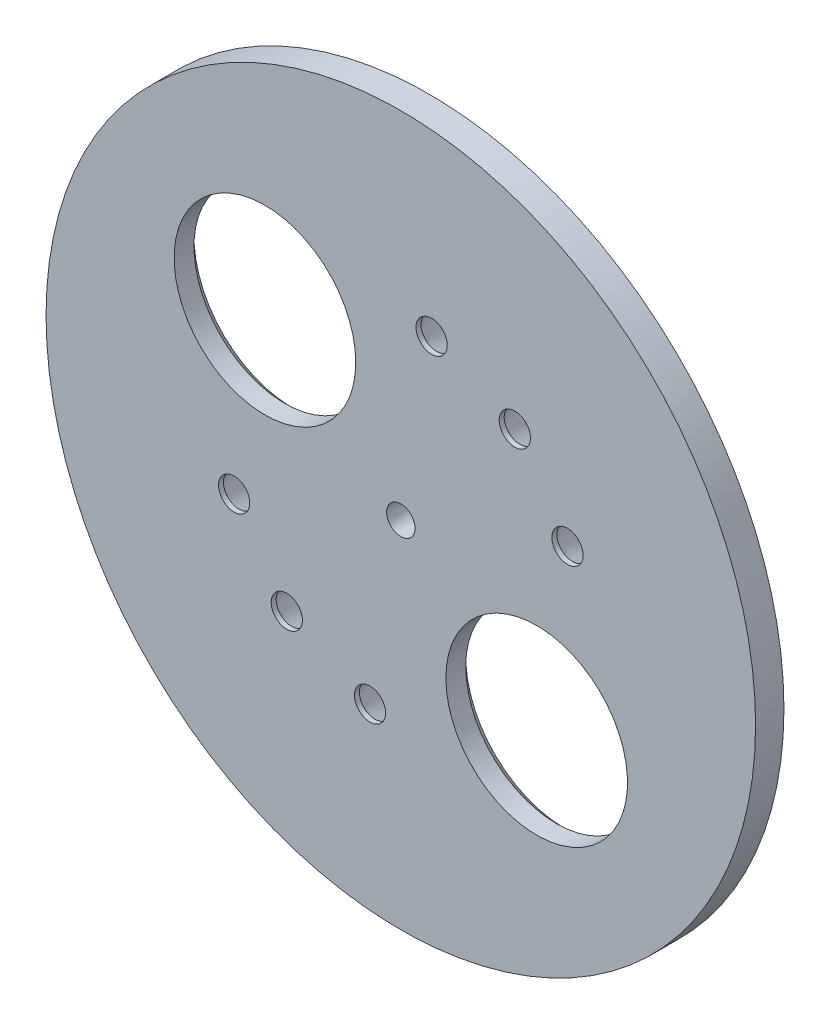
ISO-10303-21;
HEADER;
FILE_DESCRIPTION(('STEP AP214'),'2;1');
FILE_NAME('part.step','',(''),(''),'','','');
FILE_SCHEMA(('AUTOMOTIVE_DESIGN { 1 0 10303 214 1 1 1 1 }'));
ENDSEC;
DATA;
#1=APPLICATION_CONTEXT('core data for automotive mechanical design processes');
#2=APPLICATION_PROTOCOL_DEFINITION('international standard','automotive_design',2000,#1);
#3=PRODUCT_CONTEXT('',#1,'mechanical');
#4=PRODUCT('Part','Part','',(#3));
#5=PRODUCT_RELATED_PRODUCT_CATEGORY('part','',(#4));
#6=PRODUCT_DEFINITION_FORMATION('','',#4);
#7=PRODUCT_DEFINITION_CONTEXT('part definition',#1,'design');
#8=PRODUCT_DEFINITION('design','',#6,#7);
#9=PRODUCT_DEFINITION_SHAPE('','',#8);
#10=(LENGTH_UNIT() NAMED_UNIT(*) SI_UNIT(.MILLI.,.METRE.));
#11=(NAMED_UNIT(*) PLANE_ANGLE_UNIT() SI_UNIT($,.RADIAN.));
#12=(NAMED_UNIT(*) SI_UNIT($,.STERADIAN.) SOLID_ANGLE_UNIT());
#13=UNCERTAINTY_MEASURE_WITH_UNIT(LENGTH_MEASURE(1.E-05),#10,'distance_accuracy_value','');
#14=(GEOMETRIC_REPRESENTATION_CONTEXT(3) GLOBAL_UNCERTAINTY_ASSIGNED_CONTEXT((#13)) GLOBAL_UNIT_ASSIGNED_CONTEXT((#10,
#11,#12)) REPRESENTATION_CONTEXT('',''));
#15=CARTESIAN_POINT('',(0.,0.,0.));
#16=DIRECTION('',(0.,0.,1.));
#17=DIRECTION('',(1.,0.,0.));
#18=AXIS2_PLACEMENT_3D('',#15,#16,#17);
#19=CARTESIAN_POINT('',(0.,0.,10.));
#20=DIRECTION('',(0.,0.,-1.));
#21=DIRECTION('',(-1.,0.,0.));
#22=AXIS2_PLACEMENT_3D('',#19,#20,#21);
#23=CYLINDRICAL_SURFACE('',#22,125.);
#24=CARTESIAN_POINT('',(0.,0.,10.));
#25=DIRECTION('',(0.,0.,1.));
#26=DIRECTION('',(1.,0.,0.));
#27=AXIS2_PLACEMENT_3D('',#24,#25,#26);
#28=CIRCLE('',#27,125.);
#29=CARTESIAN_POINT('',(125.,0.,10.));
#30=VERTEX_POINT('',#29);
#31=EDGE_CURVE('E87',#30,#30,#28,.T.);
#32=ORIENTED_EDGE('',*,*,#31,.F.);
#33=EDGE_LOOP('',(#32));
#34=FACE_BOUND('',#33,.T.);
#35=CARTESIAN_POINT('',(0.,0.,0.));
#36=DIRECTION('',(0.,0.,1.));
#37=DIRECTION('',(1.,0.,0.));
#38=AXIS2_PLACEMENT_3D('',#35,#36,#37);
#39=CIRCLE('',#38,125.);
#40=CARTESIAN_POINT('',(125.,0.,0.));
#41=VERTEX_POINT('',#40);
#42=EDGE_CURVE('E88',#41,#41,#39,.T.);
#43=ORIENTED_EDGE('',*,*,#42,.T.);
#44=EDGE_LOOP('',(#43));
#45=FACE_BOUND('',#44,.T.);
#46=ADVANCED_FACE('F31',(#34,#45),#23,.T.);
#47=CARTESIAN_POINT('',(0.,0.,10.));
#48=DIRECTION('',(0.,0.,1.));
#49=DIRECTION('',(1.,0.,0.));
#50=AXIS2_PLACEMENT_3D('',#47,#48,#49);
#51=PLANE('',#50);
#52=CARTESIAN_POINT('',(-47.8777776949364,40.1742256054084,10.));
#53=DIRECTION('',(0.,0.,-1.));
#54=DIRECTION('',(1.,0.,0.));
#55=AXIS2_PLACEMENT_3D('',#52,#53,#54);
#56=CIRCLE('',#55,32.);
#57=CARTESIAN_POINT('',(-15.8777776949364,40.1742256054084,10.));
#58=VERTEX_POINT('',#57);
#59=EDGE_CURVE('E98',#58,#58,#56,.T.);
#60=ORIENTED_EDGE('',*,*,#59,.T.);
#61=EDGE_LOOP('',(#60));
#62=FACE_BOUND('',#61,.T.);
#63=CARTESIAN_POINT('',(10.853011104183,61.550484563263,10.));
#64=DIRECTION('',(0.,0.,-1.));
#65=DIRECTION('',(1.,0.,0.));
#66=AXIS2_PLACEMENT_3D('',#63,#64,#65);
#67=CIRCLE('',#66,5.5);
#68=CARTESIAN_POINT('',(16.3530111041829,61.550484563263,10.));
#69=VERTEX_POINT('',#68);
#70=EDGE_CURVE('E118',#69,#69,#67,.T.);
#71=ORIENTED_EDGE('',*,*,#70,.T.);
#72=EDGE_LOOP('',(#71));
#73=FACE_BOUND('',#72,.T.);
#74=CARTESIAN_POINT('',(40.1742256054086,47.8777776949362,10.));
#75=DIRECTION('',(0.,0.,-1.));
#76=DIRECTION('',(1.,0.,0.));
#77=AXIS2_PLACEMENT_3D('',#74,#75,#76);
#78=CIRCLE('',#77,5.5);
#79=CARTESIAN_POINT('',(45.6742256054086,47.8777776949362,10.));
#80=VERTEX_POINT('',#79);
#81=EDGE_CURVE('E115',#80,#80,#78,.T.);
#82=ORIENTED_EDGE('',*,*,#81,.T.);
#83=EDGE_LOOP('',(#82));
#84=FACE_BOUND('',#83,.T.);
#85=CARTESIAN_POINT('',(58.7307887991193,21.3762589578543,10.));
#86=DIRECTION('',(0.,0.,-1.));
#87=DIRECTION('',(1.,0.,0.));
#88=AXIS2_PLACEMENT_3D('',#85,#86,#87);
#89=CIRCLE('',#88,5.5);
#90=CARTESIAN_POINT('',(64.2307887991193,21.3762589578543,10.));
#91=VERTEX_POINT('',#90);
#92=EDGE_CURVE('E112',#91,#91,#89,.T.);
#93=ORIENTED_EDGE('',*,*,#92,.T.);
#94=EDGE_LOOP('',(#93));
#95=FACE_BOUND('',#94,.T.);
#96=CARTESIAN_POINT('',(0.,0.,10.));
#97=DIRECTION('',(0.,0.,-1.));
#98=DIRECTION('',(-1.,0.,0.));
#99=AXIS2_PLACEMENT_3D('',#96,#97,#98);
#100=CIRCLE('',#99,5.);
#101=CARTESIAN_POINT('',(-5.,0.,10.));
#102=VERTEX_POINT('',#101);
#103=EDGE_CURVE('E91',#102,#102,#100,.T.);
#104=ORIENTED_EDGE('',*,*,#103,.T.);
#105=EDGE_LOOP('',(#104));
#106=FACE_BOUND('',#105,.T.);
#107=CARTESIAN_POINT('',(47.8777776949364,-40.1742256054084,10.));
#108=DIRECTION('',(0.,0.,-1.));
#109=DIRECTION('',(-1.,0.,0.));
#110=AXIS2_PLACEMENT_3D('',#107,#108,#109);
#111=CIRCLE('',#110,32.);
#112=CARTESIAN_POINT('',(15.8777776949364,-40.1742256054084,10.));
#113=VERTEX_POINT('',#112);
#114=EDGE_CURVE('E104',#113,#113,#111,.T.);
#115=ORIENTED_EDGE('',*,*,#114,.T.);
#116=EDGE_LOOP('',(#115));
#117=FACE_BOUND('',#116,.T.);
#118=CARTESIAN_POINT('',(-10.853011104183,-61.550484563263,10.));
#119=DIRECTION('',(0.,0.,-1.));
#120=DIRECTION('',(-1.,0.,0.));
#121=AXIS2_PLACEMENT_3D('',#118,#119,#120);
#122=CIRCLE('',#121,5.5);
#123=CARTESIAN_POINT('',(-16.3530111041829,-61.550484563263,10.));
#124=VERTEX_POINT('',#123);
#125=EDGE_CURVE('E101',#124,#124,#122,.T.);
#126=ORIENTED_EDGE('',*,*,#125,.T.);
#127=EDGE_LOOP('',(#126));
#128=FACE_BOUND('',#127,.T.);
#129=CARTESIAN_POINT('',(-40.1742256054086,-47.8777776949362,10.));
#130=DIRECTION('',(0.,0.,-1.));
#131=DIRECTION('',(-1.,0.,0.));
#132=AXIS2_PLACEMENT_3D('',#129,#130,#131);
#133=CIRCLE('',#132,5.5);
#134=CARTESIAN_POINT('',(-45.6742256054086,-47.8777776949362,10.));
#135=VERTEX_POINT('',#134);
#136=EDGE_CURVE('E97',#135,#135,#133,.T.);
#137=ORIENTED_EDGE('',*,*,#136,.T.);
#138=EDGE_LOOP('',(#137));
#139=FACE_BOUND('',#138,.T.);
#140=CARTESIAN_POINT('',(-58.7307887991193,-21.3762589578543,10.));
#141=DIRECTION('',(0.,0.,-1.));
#142=DIRECTION('',(-1.,0.,0.));
#143=AXIS2_PLACEMENT_3D('',#140,#141,#142);
#144=CIRCLE('',#143,5.5);
#145=CARTESIAN_POINT('',(-64.2307887991193,-21.3762589578543,10.));
#146=VERTEX_POINT('',#145);
#147=EDGE_CURVE('E94',#146,#146,#144,.T.);
#148=ORIENTED_EDGE('',*,*,#147,.T.);
#149=EDGE_LOOP('',(#148));
#150=FACE_BOUND('',#149,.T.);
#151=ORIENTED_EDGE('',*,*,#31,.T.);
#152=EDGE_LOOP('',(#151));
#153=FACE_BOUND('',#152,.T.);
#154=ADVANCED_FACE('F124',(#62,#73,#84,#95,#106,#117,#128,#139,#150,#153),#51,.T.);
#155=CARTESIAN_POINT('',(0.,0.,0.));
#156=DIRECTION('',(0.,0.,1.));
#157=DIRECTION('',(1.,0.,0.));
#158=AXIS2_PLACEMENT_3D('',#155,#156,#157);
#159=PLANE('',#158);
#160=CARTESIAN_POINT('',(58.7307887991193,21.3762589578543,0.));
#161=DIRECTION('',(0.,0.,1.));
#162=DIRECTION('',(1.,0.,0.));
#163=AXIS2_PLACEMENT_3D('',#160,#161,#162);
#164=CIRCLE('',#163,8.49999999999996);
#165=CARTESIAN_POINT('',(67.2307887991192,21.3762589578543,0.));
#166=VERTEX_POINT('',#165);
#167=EDGE_CURVE('E42',#166,#166,#164,.T.);
#168=ORIENTED_EDGE('',*,*,#167,.T.);
#169=EDGE_LOOP('',(#168));
#170=FACE_BOUND('',#169,.T.);
#171=CARTESIAN_POINT('',(40.1742256054086,47.8777776949362,0.));
#172=DIRECTION('',(0.,0.,1.));
#173=DIRECTION('',(1.,0.,0.));
#174=AXIS2_PLACEMENT_3D('',#171,#172,#173);
#175=CIRCLE('',#174,8.49999999999997);
#176=CARTESIAN_POINT('',(48.6742256054086,47.8777776949362,0.));
#177=VERTEX_POINT('',#176);
#178=EDGE_CURVE('E46',#177,#177,#175,.T.);
#179=ORIENTED_EDGE('',*,*,#178,.T.);
#180=EDGE_LOOP('',(#179));
#181=FACE_BOUND('',#180,.T.);
#182=CARTESIAN_POINT('',(10.853011104183,61.550484563263,0.));
#183=DIRECTION('',(0.,0.,1.));
#184=DIRECTION('',(1.,0.,0.));
#185=AXIS2_PLACEMENT_3D('',#182,#183,#184);
#186=CIRCLE('',#185,8.49999999999997);
#187=CARTESIAN_POINT('',(19.3530111041829,61.550484563263,0.));
#188=VERTEX_POINT('',#187);
#189=EDGE_CURVE('E51',#188,#188,#186,.T.);
#190=ORIENTED_EDGE('',*,*,#189,.T.);
#191=EDGE_LOOP('',(#190));
#192=FACE_BOUND('',#191,.T.);
#193=CARTESIAN_POINT('',(-47.8777776949364,40.1742256054084,0.));
#194=DIRECTION('',(0.,0.,1.));
#195=DIRECTION('',(1.,0.,0.));
#196=AXIS2_PLACEMENT_3D('',#193,#194,#195);
#197=CIRCLE('',#196,35.);
#198=CARTESIAN_POINT('',(-12.8777776949364,40.1742256054084,0.));
#199=VERTEX_POINT('',#198);
#200=EDGE_CURVE('E57',#199,#199,#197,.T.);
#201=ORIENTED_EDGE('',*,*,#200,.T.);
#202=EDGE_LOOP('',(#201));
#203=FACE_BOUND('',#202,.T.);
#204=CARTESIAN_POINT('',(-58.7307887991193,-21.3762589578543,0.));
#205=DIRECTION('',(0.,0.,1.));
#206=DIRECTION('',(1.,0.,0.));
#207=AXIS2_PLACEMENT_3D('',#204,#205,#206);
#208=CIRCLE('',#207,8.49999999999996);
#209=CARTESIAN_POINT('',(-50.2307887991193,-21.3762589578543,0.));
#210=VERTEX_POINT('',#209);
#211=EDGE_CURVE('E69',#210,#210,#208,.T.);
#212=ORIENTED_EDGE('',*,*,#211,.T.);
#213=EDGE_LOOP('',(#212));
#214=FACE_BOUND('',#213,.T.);
#215=CARTESIAN_POINT('',(-40.1742256054086,-47.8777776949362,0.));
#216=DIRECTION('',(0.,0.,1.));
#217=DIRECTION('',(1.,0.,0.));
#218=AXIS2_PLACEMENT_3D('',#215,#216,#217);
#219=CIRCLE('',#218,8.49999999999997);
#220=CARTESIAN_POINT('',(-31.6742256054087,-47.8777776949362,0.));
#221=VERTEX_POINT('',#220);
#222=EDGE_CURVE('E72',#221,#221,#219,.T.);
#223=ORIENTED_EDGE('',*,*,#222,.T.);
#224=EDGE_LOOP('',(#223));
#225=FACE_BOUND('',#224,.T.);
#226=CARTESIAN_POINT('',(-10.853011104183,-61.550484563263,0.));
#227=DIRECTION('',(0.,0.,1.));
#228=DIRECTION('',(1.,0.,0.));
#229=AXIS2_PLACEMENT_3D('',#226,#227,#228);
#230=CIRCLE('',#229,8.49999999999997);
#231=CARTESIAN_POINT('',(-2.35301110418299,-61.550484563263,0.));
#232=VERTEX_POINT('',#231);
#233=EDGE_CURVE('E75',#232,#232,#230,.T.);
#234=ORIENTED_EDGE('',*,*,#233,.T.);
#235=EDGE_LOOP('',(#234));
#236=FACE_BOUND('',#235,.T.);
#237=CARTESIAN_POINT('',(47.8777776949364,-40.1742256054084,0.));
#238=DIRECTION('',(0.,0.,1.));
#239=DIRECTION('',(1.,0.,0.));
#240=AXIS2_PLACEMENT_3D('',#237,#238,#239);
#241=CIRCLE('',#240,35.);
#242=CARTESIAN_POINT('',(82.8777776949363,-40.1742256054084,0.));
#243=VERTEX_POINT('',#242);
#244=EDGE_CURVE('E81',#243,#243,#241,.T.);
#245=ORIENTED_EDGE('',*,*,#244,.T.);
#246=EDGE_LOOP('',(#245));
#247=FACE_BOUND('',#246,.T.);
#248=CARTESIAN_POINT('',(0.,0.,0.));
#249=DIRECTION('',(0.,0.,-1.));
#250=DIRECTION('',(-1.,0.,0.));
#251=AXIS2_PLACEMENT_3D('',#248,#249,#250);
#252=CIRCLE('',#251,5.);
#253=CARTESIAN_POINT('',(-5.,0.,0.));
#254=VERTEX_POINT('',#253);
#255=EDGE_CURVE('E107',#254,#254,#252,.T.);
#256=ORIENTED_EDGE('',*,*,#255,.F.);
#257=EDGE_LOOP('',(#256));
#258=FACE_BOUND('',#257,.T.);
#259=ORIENTED_EDGE('',*,*,#42,.F.);
#260=EDGE_LOOP('',(#259));
#261=FACE_BOUND('',#260,.T.);
#262=ADVANCED_FACE('F148',(#170,#181,#192,#203,#214,#225,#236,#247,#258,#261),#159,.F.);
#263=CARTESIAN_POINT('',(-58.7307887991193,-21.3762589578543,10.));
#264=DIRECTION('',(0.,0.,-1.));
#265=DIRECTION('',(-1.,0.,0.));
#266=AXIS2_PLACEMENT_3D('',#263,#264,#265);
#267=CYLINDRICAL_SURFACE('',#266,5.5);
#268=CARTESIAN_POINT('',(-58.7307887991193,-21.3762589578543,8.24243225836378));
#269=DIRECTION('',(0.,0.,1.));
#270=DIRECTION('',(1.,0.,0.));
#271=AXIS2_PLACEMENT_3D('',#268,#269,#270);
#272=CIRCLE('',#271,5.5);
#273=CARTESIAN_POINT('',(-53.2307887991193,-21.3762589578543,8.24243225836378));
#274=VERTEX_POINT('',#273);
#275=EDGE_CURVE('E78',#274,#274,#272,.F.);
#276=ORIENTED_EDGE('',*,*,#275,.T.);
#277=EDGE_LOOP('',(#276));
#278=FACE_BOUND('',#277,.T.);
#279=ORIENTED_EDGE('',*,*,#147,.F.);
#280=EDGE_LOOP('',(#279));
#281=FACE_BOUND('',#280,.T.);
#282=ADVANCED_FACE('F186',(#278,#281),#267,.F.);
#283=CARTESIAN_POINT('',(-40.1742256054086,-47.8777776949362,10.));
#284=DIRECTION('',(0.,0.,-1.));
#285=DIRECTION('',(-1.,0.,0.));
#286=AXIS2_PLACEMENT_3D('',#283,#284,#285);
#287=CYLINDRICAL_SURFACE('',#286,5.5);
#288=CARTESIAN_POINT('',(-40.1742256054086,-47.8777776949362,8.24243225836378));
#289=DIRECTION('',(0.,0.,1.));
#290=DIRECTION('',(1.,0.,0.));
#291=AXIS2_PLACEMENT_3D('',#288,#289,#290);
#292=CIRCLE('',#291,5.5);
#293=CARTESIAN_POINT('',(-34.6742256054086,-47.8777776949362,8.24243225836378));
#294=VERTEX_POINT('',#293);
#295=EDGE_CURVE('E66',#294,#294,#292,.F.);
#296=ORIENTED_EDGE('',*,*,#295,.T.);
#297=EDGE_LOOP('',(#296));
#298=FACE_BOUND('',#297,.T.);
#299=ORIENTED_EDGE('',*,*,#136,.F.);
#300=EDGE_LOOP('',(#299));
#301=FACE_BOUND('',#300,.T.);
#302=ADVANCED_FACE('F220',(#298,#301),#287,.F.);
#303=CARTESIAN_POINT('',(-10.853011104183,-61.550484563263,10.));
#304=DIRECTION('',(0.,0.,-1.));
#305=DIRECTION('',(-1.,0.,0.));
#306=AXIS2_PLACEMENT_3D('',#303,#304,#305);
#307=CYLINDRICAL_SURFACE('',#306,5.5);
#308=CARTESIAN_POINT('',(-10.853011104183,-61.550484563263,8.24243225836378));
#309=DIRECTION('',(0.,0.,1.));
#310=DIRECTION('',(1.,0.,0.));
#311=AXIS2_PLACEMENT_3D('',#308,#309,#310);
#312=CIRCLE('',#311,5.5);
#313=CARTESIAN_POINT('',(-5.35301110418296,-61.550484563263,8.24243225836378));
#314=VERTEX_POINT('',#313);
#315=EDGE_CURVE('E63',#314,#314,#312,.F.);
#316=ORIENTED_EDGE('',*,*,#315,.T.);
#317=EDGE_LOOP('',(#316));
#318=FACE_BOUND('',#317,.T.);
#319=ORIENTED_EDGE('',*,*,#125,.F.);
#320=EDGE_LOOP('',(#319));
#321=FACE_BOUND('',#320,.T.);
#322=ADVANCED_FACE('F211',(#318,#321),#307,.F.);
#323=CARTESIAN_POINT('',(47.8777776949364,-40.1742256054084,10.));
#324=DIRECTION('',(0.,0.,-1.));
#325=DIRECTION('',(-1.,0.,0.));
#326=AXIS2_PLACEMENT_3D('',#323,#324,#325);
#327=CYLINDRICAL_SURFACE('',#326,32.);
#328=CARTESIAN_POINT('',(47.8777776949364,-40.1742256054084,2.99999999999998));
#329=DIRECTION('',(0.,0.,1.));
#330=DIRECTION('',(1.,0.,0.));
#331=AXIS2_PLACEMENT_3D('',#328,#329,#330);
#332=CIRCLE('',#331,32.);
#333=CARTESIAN_POINT('',(79.8777776949364,-40.1742256054084,2.99999999999998));
#334=VERTEX_POINT('',#333);
#335=EDGE_CURVE('E84',#334,#334,#332,.F.);
#336=ORIENTED_EDGE('',*,*,#335,.T.);
#337=EDGE_LOOP('',(#336));
#338=FACE_BOUND('',#337,.T.);
#339=ORIENTED_EDGE('',*,*,#114,.F.);
#340=EDGE_LOOP('',(#339));
#341=FACE_BOUND('',#340,.T.);
#342=ADVANCED_FACE('F205',(#338,#341),#327,.F.);
#343=CARTESIAN_POINT('',(0.,0.,10.));
#344=DIRECTION('',(0.,0.,-1.));
#345=DIRECTION('',(-1.,0.,0.));
#346=AXIS2_PLACEMENT_3D('',#343,#344,#345);
#347=CYLINDRICAL_SURFACE('',#346,5.);
#348=ORIENTED_EDGE('',*,*,#103,.F.);
#349=EDGE_LOOP('',(#348));
#350=FACE_BOUND('',#349,.T.);
#351=ORIENTED_EDGE('',*,*,#255,.T.);
#352=EDGE_LOOP('',(#351));
#353=FACE_BOUND('',#352,.T.);
#354=ADVANCED_FACE('F158',(#350,#353),#347,.F.);
#355=CARTESIAN_POINT('',(47.8777776949364,-40.1742256054084,2.99999999999998));
#356=DIRECTION('',(0.,0.,-1.));
#357=DIRECTION('',(-1.,0.,0.));
#358=AXIS2_PLACEMENT_3D('',#355,#356,#357);
#359=CONICAL_SURFACE('',#358,32.,0.78539816339745);
#360=ORIENTED_EDGE('',*,*,#244,.F.);
#361=EDGE_LOOP('',(#360));
#362=FACE_BOUND('',#361,.T.);
#363=ORIENTED_EDGE('',*,*,#335,.F.);
#364=EDGE_LOOP('',(#363));
#365=FACE_BOUND('',#364,.T.);
#366=ADVANCED_FACE('F154',(#362,#365),#359,.F.);
#367=CARTESIAN_POINT('',(-58.7307887991193,-21.3762589578543,8.24243225836378));
#368=DIRECTION('',(0.,0.,-1.));
#369=DIRECTION('',(-1.,0.,0.));
#370=AXIS2_PLACEMENT_3D('',#367,#368,#369);
#371=CONICAL_SURFACE('',#370,5.5,0.349065850398866);
#372=ORIENTED_EDGE('',*,*,#211,.F.);
#373=EDGE_LOOP('',(#372));
#374=FACE_BOUND('',#373,.T.);
#375=ORIENTED_EDGE('',*,*,#275,.F.);
#376=EDGE_LOOP('',(#375));
#377=FACE_BOUND('',#376,.T.);
#378=ADVANCED_FACE('F157',(#374,#377),#371,.F.);
#379=CARTESIAN_POINT('',(-40.1742256054086,-47.8777776949362,8.24243225836378));
#380=DIRECTION('',(0.,0.,-1.));
#381=DIRECTION('',(-1.,0.,0.));
#382=AXIS2_PLACEMENT_3D('',#379,#380,#381);
#383=CONICAL_SURFACE('',#382,5.5,0.349065850398866);
#384=ORIENTED_EDGE('',*,*,#222,.F.);
#385=EDGE_LOOP('',(#384));
#386=FACE_BOUND('',#385,.T.);
#387=ORIENTED_EDGE('',*,*,#295,.F.);
#388=EDGE_LOOP('',(#387));
#389=FACE_BOUND('',#388,.T.);
#390=ADVANCED_FACE('F162',(#386,#389),#383,.F.);
#391=CARTESIAN_POINT('',(-10.853011104183,-61.550484563263,8.24243225836378));
#392=DIRECTION('',(0.,0.,-1.));
#393=DIRECTION('',(-1.,0.,0.));
#394=AXIS2_PLACEMENT_3D('',#391,#392,#393);
#395=CONICAL_SURFACE('',#394,5.5,0.349065850398866);
#396=ORIENTED_EDGE('',*,*,#233,.F.);
#397=EDGE_LOOP('',(#396));
#398=FACE_BOUND('',#397,.T.);
#399=ORIENTED_EDGE('',*,*,#315,.F.);
#400=EDGE_LOOP('',(#399));
#401=FACE_BOUND('',#400,.T.);
#402=ADVANCED_FACE('F166',(#398,#401),#395,.F.);
#403=CARTESIAN_POINT('',(58.7307887991193,21.3762589578543,10.));
#404=DIRECTION('',(0.,0.,-1.));
#405=DIRECTION('',(-1.,0.,0.));
#406=AXIS2_PLACEMENT_3D('',#403,#404,#405);
#407=CYLINDRICAL_SURFACE('',#406,5.5);
#408=CARTESIAN_POINT('',(58.7307887991193,21.3762589578543,8.24243225836378));
#409=DIRECTION('',(0.,0.,1.));
#410=DIRECTION('',(1.,0.,0.));
#411=AXIS2_PLACEMENT_3D('',#408,#409,#410);
#412=CIRCLE('',#411,5.5);
#413=CARTESIAN_POINT('',(64.2307887991193,21.3762589578543,8.24243225836378));
#414=VERTEX_POINT('',#413);
#415=EDGE_CURVE('E54',#414,#414,#412,.F.);
#416=ORIENTED_EDGE('',*,*,#415,.T.);
#417=EDGE_LOOP('',(#416));
#418=FACE_BOUND('',#417,.T.);
#419=ORIENTED_EDGE('',*,*,#92,.F.);
#420=EDGE_LOOP('',(#419));
#421=FACE_BOUND('',#420,.T.);
#422=ADVANCED_FACE('F169',(#418,#421),#407,.F.);
#423=CARTESIAN_POINT('',(40.1742256054086,47.8777776949362,10.));
#424=DIRECTION('',(0.,0.,-1.));
#425=DIRECTION('',(-1.,0.,0.));
#426=AXIS2_PLACEMENT_3D('',#423,#424,#425);
#427=CYLINDRICAL_SURFACE('',#426,5.5);
#428=CARTESIAN_POINT('',(40.1742256054086,47.8777776949362,8.24243225836378));
#429=DIRECTION('',(0.,0.,1.));
#430=DIRECTION('',(1.,0.,0.));
#431=AXIS2_PLACEMENT_3D('',#428,#429,#430);
#432=CIRCLE('',#431,5.5);
#433=CARTESIAN_POINT('',(45.6742256054086,47.8777776949362,8.24243225836378));
#434=VERTEX_POINT('',#433);
#435=EDGE_CURVE('E38',#434,#434,#432,.F.);
#436=ORIENTED_EDGE('',*,*,#435,.T.);
#437=EDGE_LOOP('',(#436));
#438=FACE_BOUND('',#437,.T.);
#439=ORIENTED_EDGE('',*,*,#81,.F.);
#440=EDGE_LOOP('',(#439));
#441=FACE_BOUND('',#440,.T.);
#442=ADVANCED_FACE('F140',(#438,#441),#427,.F.);
#443=CARTESIAN_POINT('',(10.853011104183,61.550484563263,10.));
#444=DIRECTION('',(0.,0.,-1.));
#445=DIRECTION('',(-1.,0.,0.));
#446=AXIS2_PLACEMENT_3D('',#443,#444,#445);
#447=CYLINDRICAL_SURFACE('',#446,5.5);
#448=CARTESIAN_POINT('',(10.853011104183,61.550484563263,8.24243225836378));
#449=DIRECTION('',(0.,0.,1.));
#450=DIRECTION('',(1.,0.,0.));
#451=AXIS2_PLACEMENT_3D('',#448,#449,#450);
#452=CIRCLE('',#451,5.5);
#453=CARTESIAN_POINT('',(16.3530111041829,61.550484563263,8.24243225836378));
#454=VERTEX_POINT('',#453);
#455=EDGE_CURVE('E10',#454,#454,#452,.F.);
#456=ORIENTED_EDGE('',*,*,#455,.T.);
#457=EDGE_LOOP('',(#456));
#458=FACE_BOUND('',#457,.T.);
#459=ORIENTED_EDGE('',*,*,#70,.F.);
#460=EDGE_LOOP('',(#459));
#461=FACE_BOUND('',#460,.T.);
#462=ADVANCED_FACE('F130',(#458,#461),#447,.F.);
#463=CARTESIAN_POINT('',(-47.8777776949364,40.1742256054084,10.));
#464=DIRECTION('',(0.,0.,-1.));
#465=DIRECTION('',(-1.,0.,0.));
#466=AXIS2_PLACEMENT_3D('',#463,#464,#465);
#467=CYLINDRICAL_SURFACE('',#466,32.);
#468=CARTESIAN_POINT('',(-47.8777776949364,40.1742256054084,2.99999999999998));
#469=DIRECTION('',(0.,0.,1.));
#470=DIRECTION('',(1.,0.,0.));
#471=AXIS2_PLACEMENT_3D('',#468,#469,#470);
#472=CIRCLE('',#471,32.);
#473=CARTESIAN_POINT('',(-15.8777776949364,40.1742256054084,2.99999999999998));
#474=VERTEX_POINT('',#473);
#475=EDGE_CURVE('E60',#474,#474,#472,.F.);
#476=ORIENTED_EDGE('',*,*,#475,.T.);
#477=EDGE_LOOP('',(#476));
#478=FACE_BOUND('',#477,.T.);
#479=ORIENTED_EDGE('',*,*,#59,.F.);
#480=EDGE_LOOP('',(#479));
#481=FACE_BOUND('',#480,.T.);
#482=ADVANCED_FACE('F127',(#478,#481),#467,.F.);
#483=CARTESIAN_POINT('',(-47.8777776949364,40.1742256054084,2.99999999999998));
#484=DIRECTION('',(0.,0.,-1.));
#485=DIRECTION('',(-1.,0.,0.));
#486=AXIS2_PLACEMENT_3D('',#483,#484,#485);
#487=CONICAL_SURFACE('',#486,32.,0.78539816339745);
#488=ORIENTED_EDGE('',*,*,#200,.F.);
#489=EDGE_LOOP('',(#488));
#490=FACE_BOUND('',#489,.T.);
#491=ORIENTED_EDGE('',*,*,#475,.F.);
#492=EDGE_LOOP('',(#491));
#493=FACE_BOUND('',#492,.T.);
#494=ADVANCED_FACE('F129',(#490,#493),#487,.F.);
#495=CARTESIAN_POINT('',(58.7307887991193,21.3762589578543,8.24243225836378));
#496=DIRECTION('',(0.,0.,-1.));
#497=DIRECTION('',(-1.,0.,0.));
#498=AXIS2_PLACEMENT_3D('',#495,#496,#497);
#499=CONICAL_SURFACE('',#498,5.5,0.349065850398866);
#500=ORIENTED_EDGE('',*,*,#167,.F.);
#501=EDGE_LOOP('',(#500));
#502=FACE_BOUND('',#501,.T.);
#503=ORIENTED_EDGE('',*,*,#415,.F.);
#504=EDGE_LOOP('',(#503));
#505=FACE_BOUND('',#504,.T.);
#506=ADVANCED_FACE('F137',(#502,#505),#499,.F.);
#507=CARTESIAN_POINT('',(40.1742256054086,47.8777776949362,8.24243225836378));
#508=DIRECTION('',(0.,0.,-1.));
#509=DIRECTION('',(-1.,0.,0.));
#510=AXIS2_PLACEMENT_3D('',#507,#508,#509);
#511=CONICAL_SURFACE('',#510,5.5,0.349065850398866);
#512=ORIENTED_EDGE('',*,*,#178,.F.);
#513=EDGE_LOOP('',(#512));
#514=FACE_BOUND('',#513,.T.);
#515=ORIENTED_EDGE('',*,*,#435,.F.);
#516=EDGE_LOOP('',(#515));
#517=FACE_BOUND('',#516,.T.);
#518=ADVANCED_FACE('F173',(#514,#517),#511,.F.);
#519=CARTESIAN_POINT('',(10.853011104183,61.550484563263,8.24243225836378));
#520=DIRECTION('',(0.,0.,-1.));
#521=DIRECTION('',(-1.,0.,0.));
#522=AXIS2_PLACEMENT_3D('',#519,#520,#521);
#523=CONICAL_SURFACE('',#522,5.5,0.349065850398866);
#524=ORIENTED_EDGE('',*,*,#189,.F.);
#525=EDGE_LOOP('',(#524));
#526=FACE_BOUND('',#525,.T.);
#527=ORIENTED_EDGE('',*,*,#455,.F.);
#528=EDGE_LOOP('',(#527));
#529=FACE_BOUND('',#528,.T.);
#530=ADVANCED_FACE('F33',(#526,#529),#523,.F.);
#531=CLOSED_SHELL('',(#46,#154,#262,#282,#302,#322,#342,#354,#366,#378,#390,#402,#422,#442,#462,
#482,#494,#506,#518,#530));
#532=MANIFOLD_SOLID_BREP('B2',#531);
#533=ADVANCED_BREP_SHAPE_REPRESENTATION('',(#18,#532),#14);
#534=SHAPE_DEFINITION_REPRESENTATION(#9,#533);
ENDSEC;
END-ISO-10303-21;
